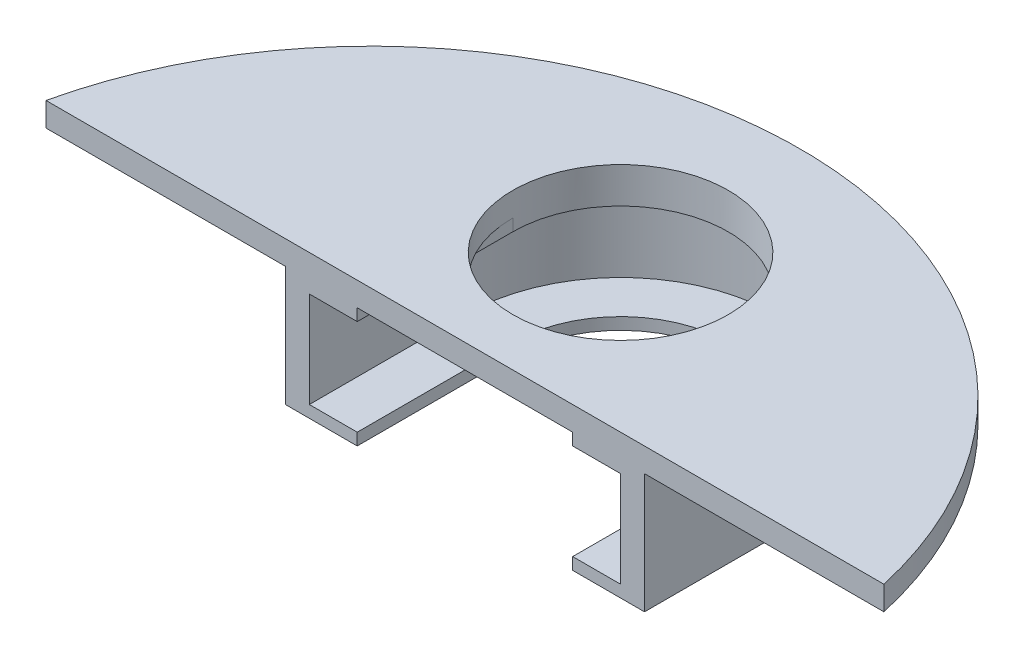
ISO-10303-21;
HEADER;
FILE_DESCRIPTION(('STEP AP214'),'2;1');
FILE_NAME('part.step','',(''),(''),'','','');
FILE_SCHEMA(('AUTOMOTIVE_DESIGN { 1 0 10303 214 1 1 1 1 }'));
ENDSEC;
DATA;
#1=APPLICATION_CONTEXT('core data for automotive mechanical design processes');
#2=APPLICATION_PROTOCOL_DEFINITION('international standard','automotive_design',2000,#1);
#3=PRODUCT_CONTEXT('',#1,'mechanical');
#4=PRODUCT('Part','Part','',(#3));
#5=PRODUCT_RELATED_PRODUCT_CATEGORY('part','',(#4));
#6=PRODUCT_DEFINITION_FORMATION('','',#4);
#7=PRODUCT_DEFINITION_CONTEXT('part definition',#1,'design');
#8=PRODUCT_DEFINITION('design','',#6,#7);
#9=PRODUCT_DEFINITION_SHAPE('','',#8);
#10=(LENGTH_UNIT() NAMED_UNIT(*) SI_UNIT(.MILLI.,.METRE.));
#11=(NAMED_UNIT(*) PLANE_ANGLE_UNIT() SI_UNIT($,.RADIAN.));
#12=(NAMED_UNIT(*) SI_UNIT($,.STERADIAN.) SOLID_ANGLE_UNIT());
#13=UNCERTAINTY_MEASURE_WITH_UNIT(LENGTH_MEASURE(1.E-05),#10,'distance_accuracy_value','');
#14=(GEOMETRIC_REPRESENTATION_CONTEXT(3) GLOBAL_UNCERTAINTY_ASSIGNED_CONTEXT((#13)) GLOBAL_UNIT_ASSIGNED_CONTEXT((#10,
#11,#12)) REPRESENTATION_CONTEXT('',''));
#15=CARTESIAN_POINT('',(0.,0.,0.));
#16=DIRECTION('',(0.,0.,1.));
#17=DIRECTION('',(1.,0.,0.));
#18=AXIS2_PLACEMENT_3D('',#15,#16,#17);
#19=CARTESIAN_POINT('',(0.,0.,0.));
#20=DIRECTION('',(0.,1.,0.));
#21=DIRECTION('',(0.,0.,1.));
#22=AXIS2_PLACEMENT_3D('',#19,#20,#21);
#23=PLANE('',#22);
#24=DIRECTION('',(0.,0.,1.));
#25=VECTOR('',#24,1.);
#26=CARTESIAN_POINT('',(-9.,0.,0.));
#27=LINE('',#26,#25);
#28=CARTESIAN_POINT('',(-9.,0.,0.));
#29=VERTEX_POINT('',#28);
#30=CARTESIAN_POINT('',(-9.,0.,13.));
#31=VERTEX_POINT('',#30);
#32=EDGE_CURVE('E117',#29,#31,#27,.T.);
#33=ORIENTED_EDGE('',*,*,#32,.F.);
#34=CARTESIAN_POINT('',(0.,0.,0.));
#35=DIRECTION('',(0.,1.,0.));
#36=DIRECTION('',(0.,0.,1.));
#37=AXIS2_PLACEMENT_3D('',#34,#35,#36);
#38=CIRCLE('',#37,9.);
#39=CARTESIAN_POINT('',(9.,0.,0.));
#40=VERTEX_POINT('',#39);
#41=EDGE_CURVE('E121',#29,#40,#38,.T.);
#42=ORIENTED_EDGE('',*,*,#41,.T.);
#43=DIRECTION('',(0.,0.,1.));
#44=VECTOR('',#43,1.);
#45=CARTESIAN_POINT('',(9.,0.,0.));
#46=LINE('',#45,#44);
#47=CARTESIAN_POINT('',(9.,0.,13.));
#48=VERTEX_POINT('',#47);
#49=EDGE_CURVE('E309',#40,#48,#46,.T.);
#50=ORIENTED_EDGE('',*,*,#49,.T.);
#51=DIRECTION('',(1.,0.,0.));
#52=VECTOR('',#51,1.);
#53=CARTESIAN_POINT('',(0.,0.,13.));
#54=LINE('',#53,#52);
#55=EDGE_CURVE('E418',#31,#48,#54,.T.);
#56=ORIENTED_EDGE('',*,*,#55,.F.);
#57=EDGE_LOOP('',(#33,#42,#50,#56));
#58=FACE_BOUND('',#57,.T.);
#59=ADVANCED_FACE('F99',(#58),#23,.F.);
#60=CARTESIAN_POINT('',(13.,-9.,0.));
#61=DIRECTION('',(-1.,0.,0.));
#62=DIRECTION('',(0.,0.,1.));
#63=AXIS2_PLACEMENT_3D('',#60,#61,#62);
#64=PLANE('',#63);
#65=DIRECTION('',(0.,1.,0.));
#66=VECTOR('',#65,1.);
#67=CARTESIAN_POINT('',(13.,-9.,13.));
#68=LINE('',#67,#66);
#69=CARTESIAN_POINT('',(13.,-9.,13.));
#70=VERTEX_POINT('',#69);
#71=CARTESIAN_POINT('',(13.,-0.999999999999999,13.));
#72=VERTEX_POINT('',#71);
#73=EDGE_CURVE('E239',#70,#72,#68,.T.);
#74=ORIENTED_EDGE('',*,*,#73,.T.);
#75=DIRECTION('',(0.,0.,1.));
#76=VECTOR('',#75,1.);
#77=CARTESIAN_POINT('',(13.,-1.,0.));
#78=LINE('',#77,#76);
#79=CARTESIAN_POINT('',(13.,-0.999999999999999,0.));
#80=VERTEX_POINT('',#79);
#81=EDGE_CURVE('E322',#80,#72,#78,.T.);
#82=ORIENTED_EDGE('',*,*,#81,.F.);
#83=DIRECTION('',(0.,1.,0.));
#84=VECTOR('',#83,1.);
#85=CARTESIAN_POINT('',(13.,-9.,0.));
#86=LINE('',#85,#84);
#87=CARTESIAN_POINT('',(13.,-9.,0.));
#88=VERTEX_POINT('',#87);
#89=EDGE_CURVE('E379',#88,#80,#86,.T.);
#90=ORIENTED_EDGE('',*,*,#89,.F.);
#91=DIRECTION('',(0.,0.,1.));
#92=VECTOR('',#91,1.);
#93=CARTESIAN_POINT('',(13.,-9.,0.));
#94=LINE('',#93,#92);
#95=EDGE_CURVE('E363',#88,#70,#94,.T.);
#96=ORIENTED_EDGE('',*,*,#95,.T.);
#97=EDGE_LOOP('',(#74,#82,#90,#96));
#98=FACE_BOUND('',#97,.T.);
#99=ADVANCED_FACE('F460',(#98),#64,.T.);
#100=CARTESIAN_POINT('',(0.,-9.,0.));
#101=DIRECTION('',(0.,1.,0.));
#102=DIRECTION('',(0.,0.,1.));
#103=AXIS2_PLACEMENT_3D('',#100,#101,#102);
#104=CYLINDRICAL_SURFACE('',#103,13.);
#105=CARTESIAN_POINT('',(0.,-1.,0.));
#106=DIRECTION('',(0.,1.,0.));
#107=DIRECTION('',(0.,0.,1.));
#108=AXIS2_PLACEMENT_3D('',#105,#106,#107);
#109=CIRCLE('',#108,13.);
#110=CARTESIAN_POINT('',(-13.,-1.,0.));
#111=VERTEX_POINT('',#110);
#112=EDGE_CURVE('E327',#80,#111,#109,.T.);
#113=ORIENTED_EDGE('',*,*,#112,.T.);
#114=DIRECTION('',(0.,1.,0.));
#115=VECTOR('',#114,1.);
#116=CARTESIAN_POINT('',(-13.,-9.,0.));
#117=LINE('',#116,#115);
#118=CARTESIAN_POINT('',(-13.,-9.,0.));
#119=VERTEX_POINT('',#118);
#120=EDGE_CURVE('E383',#119,#111,#117,.T.);
#121=ORIENTED_EDGE('',*,*,#120,.F.);
#122=CARTESIAN_POINT('',(0.,-9.,0.));
#123=DIRECTION('',(0.,1.,0.));
#124=DIRECTION('',(0.,0.,1.));
#125=AXIS2_PLACEMENT_3D('',#122,#123,#124);
#126=CIRCLE('',#125,13.);
#127=EDGE_CURVE('E359',#88,#119,#126,.T.);
#128=ORIENTED_EDGE('',*,*,#127,.F.);
#129=ORIENTED_EDGE('',*,*,#89,.T.);
#130=EDGE_LOOP('',(#113,#121,#128,#129));
#131=FACE_BOUND('',#130,.T.);
#132=ADVANCED_FACE('F463',(#131),#104,.F.);
#133=CARTESIAN_POINT('',(-13.,-9.,0.));
#134=DIRECTION('',(-1.,0.,0.));
#135=DIRECTION('',(0.,0.,1.));
#136=AXIS2_PLACEMENT_3D('',#133,#134,#135);
#137=PLANE('',#136);
#138=DIRECTION('',(0.,0.,1.));
#139=VECTOR('',#138,1.);
#140=CARTESIAN_POINT('',(-13.,-1.,0.));
#141=LINE('',#140,#139);
#142=CARTESIAN_POINT('',(-13.,-0.999999999999999,13.));
#143=VERTEX_POINT('',#142);
#144=EDGE_CURVE('E331',#111,#143,#141,.T.);
#145=ORIENTED_EDGE('',*,*,#144,.T.);
#146=DIRECTION('',(0.,1.,0.));
#147=VECTOR('',#146,1.);
#148=CARTESIAN_POINT('',(-13.,-9.,13.));
#149=LINE('',#148,#147);
#150=CARTESIAN_POINT('',(-13.,-9.,13.));
#151=VERTEX_POINT('',#150);
#152=EDGE_CURVE('E386',#151,#143,#149,.T.);
#153=ORIENTED_EDGE('',*,*,#152,.F.);
#154=DIRECTION('',(0.,0.,1.));
#155=VECTOR('',#154,1.);
#156=CARTESIAN_POINT('',(-13.,-9.,0.));
#157=LINE('',#156,#155);
#158=EDGE_CURVE('E355',#119,#151,#157,.T.);
#159=ORIENTED_EDGE('',*,*,#158,.F.);
#160=ORIENTED_EDGE('',*,*,#120,.T.);
#161=EDGE_LOOP('',(#145,#153,#159,#160));
#162=FACE_BOUND('',#161,.T.);
#163=ADVANCED_FACE('F503',(#162),#137,.F.);
#164=CARTESIAN_POINT('',(0.,0.,0.));
#165=DIRECTION('',(0.,1.,0.));
#166=DIRECTION('',(0.,0.,1.));
#167=AXIS2_PLACEMENT_3D('',#164,#165,#166);
#168=CIRCLE('',#167,15.);
#169=CARTESIAN_POINT('',(0.,0.,-15.));
#170=VERTEX_POINT('',#169);
#171=CARTESIAN_POINT('',(-15.,0.,0.));
#172=VERTEX_POINT('',#171);
#173=EDGE_CURVE('E12',#170,#172,#168,.T.);
#174=ORIENTED_EDGE('',*,*,#173,.T.);
#175=DIRECTION('',(0.,0.,1.));
#176=VECTOR('',#175,1.);
#177=CARTESIAN_POINT('',(-15.,0.,0.));
#178=LINE('',#177,#176);
#179=CARTESIAN_POINT('',(-15.,0.,13.));
#180=VERTEX_POINT('',#179);
#181=EDGE_CURVE('E369',#172,#180,#178,.T.);
#182=ORIENTED_EDGE('',*,*,#181,.T.);
#183=CARTESIAN_POINT('',(-35.,0.,13.));
#184=VERTEX_POINT('',#183);
#185=EDGE_CURVE('E414',#184,#180,#54,.T.);
#186=ORIENTED_EDGE('',*,*,#185,.F.);
#187=CARTESIAN_POINT('',(0.,0.,20.875));
#188=DIRECTION('',(0.,1.,0.));
#189=DIRECTION('',(0.,0.,1.));
#190=AXIS2_PLACEMENT_3D('',#187,#188,#189);
#191=CIRCLE('',#190,35.875);
#192=EDGE_CURVE('E409',#184,#170,#191,.F.);
#193=ORIENTED_EDGE('',*,*,#192,.T.);
#194=EDGE_LOOP('',(#174,#182,#186,#193));
#195=FACE_BOUND('',#194,.T.);
#196=ADVANCED_FACE('F489',(#195),#23,.F.);
#197=CARTESIAN_POINT('',(0.,2.,0.));
#198=DIRECTION('',(0.,-1.,0.));
#199=DIRECTION('',(0.,0.,-1.));
#200=AXIS2_PLACEMENT_3D('',#197,#198,#199);
#201=CYLINDRICAL_SURFACE('',#200,9.);
#202=ORIENTED_EDGE('',*,*,#41,.F.);
#203=DIRECTION('',(0.,1.,0.));
#204=VECTOR('',#203,1.);
#205=CARTESIAN_POINT('',(-9.,-1.,0.));
#206=LINE('',#205,#204);
#207=CARTESIAN_POINT('',(-9.,-1.,0.));
#208=VERTEX_POINT('',#207);
#209=EDGE_CURVE('E342',#208,#29,#206,.T.);
#210=ORIENTED_EDGE('',*,*,#209,.F.);
#211=CARTESIAN_POINT('',(0.,-1.,0.));
#212=DIRECTION('',(0.,1.,0.));
#213=DIRECTION('',(0.,0.,1.));
#214=AXIS2_PLACEMENT_3D('',#211,#212,#213);
#215=CIRCLE('',#214,9.);
#216=CARTESIAN_POINT('',(9.,-1.,0.));
#217=VERTEX_POINT('',#216);
#218=EDGE_CURVE('E310',#217,#208,#215,.T.);
#219=ORIENTED_EDGE('',*,*,#218,.F.);
#220=DIRECTION('',(0.,1.,0.));
#221=VECTOR('',#220,1.);
#222=CARTESIAN_POINT('',(9.,-1.,0.));
#223=LINE('',#222,#221);
#224=EDGE_CURVE('E337',#217,#40,#223,.T.);
#225=ORIENTED_EDGE('',*,*,#224,.T.);
#226=EDGE_LOOP('',(#202,#210,#219,#225));
#227=FACE_BOUND('',#226,.T.);
#228=CARTESIAN_POINT('',(0.,2.,0.));
#229=DIRECTION('',(0.,1.,0.));
#230=DIRECTION('',(0.,0.,1.));
#231=AXIS2_PLACEMENT_3D('',#228,#229,#230);
#232=CIRCLE('',#231,9.);
#233=CARTESIAN_POINT('',(0.,2.,9.));
#234=VERTEX_POINT('',#233);
#235=EDGE_CURVE('E404',#234,#234,#232,.T.);
#236=ORIENTED_EDGE('',*,*,#235,.T.);
#237=EDGE_LOOP('',(#236));
#238=FACE_BOUND('',#237,.T.);
#239=ADVANCED_FACE('F452',(#227,#238),#201,.F.);
#240=DIRECTION('',(0.,0.,1.));
#241=VECTOR('',#240,1.);
#242=CARTESIAN_POINT('',(15.,0.,0.));
#243=LINE('',#242,#241);
#244=CARTESIAN_POINT('',(15.,0.,0.));
#245=VERTEX_POINT('',#244);
#246=CARTESIAN_POINT('',(15.,0.,13.));
#247=VERTEX_POINT('',#246);
#248=EDGE_CURVE('E234',#245,#247,#243,.T.);
#249=ORIENTED_EDGE('',*,*,#248,.F.);
#250=EDGE_CURVE('E110',#245,#170,#168,.T.);
#251=ORIENTED_EDGE('',*,*,#250,.T.);
#252=CARTESIAN_POINT('',(35.,0.,13.));
#253=VERTEX_POINT('',#252);
#254=EDGE_CURVE('E375',#170,#253,#191,.F.);
#255=ORIENTED_EDGE('',*,*,#254,.T.);
#256=EDGE_CURVE('E413',#247,#253,#54,.T.);
#257=ORIENTED_EDGE('',*,*,#256,.F.);
#258=EDGE_LOOP('',(#249,#251,#255,#257));
#259=FACE_BOUND('',#258,.T.);
#260=ADVANCED_FACE('F433',(#259),#23,.F.);
#261=CARTESIAN_POINT('',(0.,2.,13.));
#262=DIRECTION('',(0.,0.,-1.));
#263=DIRECTION('',(-1.,0.,0.));
#264=AXIS2_PLACEMENT_3D('',#261,#262,#263);
#265=PLANE('',#264);
#266=DIRECTION('',(0.,1.,0.));
#267=VECTOR('',#266,1.);
#268=CARTESIAN_POINT('',(-9.,-1.,13.));
#269=LINE('',#268,#267);
#270=CARTESIAN_POINT('',(-9.,-1.,13.));
#271=VERTEX_POINT('',#270);
#272=EDGE_CURVE('E346',#271,#31,#269,.T.);
#273=ORIENTED_EDGE('',*,*,#272,.T.);
#274=ORIENTED_EDGE('',*,*,#55,.T.);
#275=DIRECTION('',(0.,1.,0.));
#276=VECTOR('',#275,1.);
#277=CARTESIAN_POINT('',(9.,-1.,13.));
#278=LINE('',#277,#276);
#279=CARTESIAN_POINT('',(9.,-1.,13.));
#280=VERTEX_POINT('',#279);
#281=EDGE_CURVE('E349',#280,#48,#278,.T.);
#282=ORIENTED_EDGE('',*,*,#281,.F.);
#283=DIRECTION('',(1.,0.,0.));
#284=VECTOR('',#283,1.);
#285=CARTESIAN_POINT('',(0.,-1.,13.));
#286=LINE('',#285,#284);
#287=EDGE_CURVE('E318',#280,#72,#286,.T.);
#288=ORIENTED_EDGE('',*,*,#287,.T.);
#289=ORIENTED_EDGE('',*,*,#73,.F.);
#290=DIRECTION('',(1.,0.,0.));
#291=VECTOR('',#290,1.);
#292=CARTESIAN_POINT('',(0.,-9.,13.));
#293=LINE('',#292,#291);
#294=CARTESIAN_POINT('',(9.,-9.,13.));
#295=VERTEX_POINT('',#294);
#296=EDGE_CURVE('E280',#295,#70,#293,.T.);
#297=ORIENTED_EDGE('',*,*,#296,.F.);
#298=DIRECTION('',(0.,1.,0.));
#299=VECTOR('',#298,1.);
#300=CARTESIAN_POINT('',(9.,-10.,13.));
#301=LINE('',#300,#299);
#302=CARTESIAN_POINT('',(9.,-10.,13.));
#303=VERTEX_POINT('',#302);
#304=EDGE_CURVE('E256',#303,#295,#301,.T.);
#305=ORIENTED_EDGE('',*,*,#304,.F.);
#306=DIRECTION('',(1.,0.,0.));
#307=VECTOR('',#306,1.);
#308=CARTESIAN_POINT('',(0.,-10.,13.));
#309=LINE('',#308,#307);
#310=CARTESIAN_POINT('',(15.,-10.,13.));
#311=VERTEX_POINT('',#310);
#312=EDGE_CURVE('E245',#303,#311,#309,.T.);
#313=ORIENTED_EDGE('',*,*,#312,.T.);
#314=DIRECTION('',(0.,1.,0.));
#315=VECTOR('',#314,1.);
#316=CARTESIAN_POINT('',(15.,-9.,13.));
#317=LINE('',#316,#315);
#318=EDGE_CURVE('E228',#311,#247,#317,.T.);
#319=ORIENTED_EDGE('',*,*,#318,.T.);
#320=ORIENTED_EDGE('',*,*,#256,.T.);
#321=DIRECTION('',(0.,-1.,0.));
#322=VECTOR('',#321,1.);
#323=CARTESIAN_POINT('',(35.,2.,13.));
#324=LINE('',#323,#322);
#325=CARTESIAN_POINT('',(35.,2.,13.));
#326=VERTEX_POINT('',#325);
#327=EDGE_CURVE('E103',#326,#253,#324,.T.);
#328=ORIENTED_EDGE('',*,*,#327,.F.);
#329=DIRECTION('',(1.,0.,0.));
#330=VECTOR('',#329,1.);
#331=CARTESIAN_POINT('',(0.,2.,13.));
#332=LINE('',#331,#330);
#333=CARTESIAN_POINT('',(-35.,2.,13.));
#334=VERTEX_POINT('',#333);
#335=EDGE_CURVE('E397',#334,#326,#332,.T.);
#336=ORIENTED_EDGE('',*,*,#335,.F.);
#337=DIRECTION('',(0.,-1.,0.));
#338=VECTOR('',#337,1.);
#339=CARTESIAN_POINT('',(-35.,2.,13.));
#340=LINE('',#339,#338);
#341=EDGE_CURVE('E408',#334,#184,#340,.T.);
#342=ORIENTED_EDGE('',*,*,#341,.T.);
#343=ORIENTED_EDGE('',*,*,#185,.T.);
#344=DIRECTION('',(0.,1.,0.));
#345=VECTOR('',#344,1.);
#346=CARTESIAN_POINT('',(-15.,-9.,13.));
#347=LINE('',#346,#345);
#348=CARTESIAN_POINT('',(-15.,-10.,13.));
#349=VERTEX_POINT('',#348);
#350=EDGE_CURVE('E390',#349,#180,#347,.T.);
#351=ORIENTED_EDGE('',*,*,#350,.F.);
#352=DIRECTION('',(1.,0.,0.));
#353=VECTOR('',#352,1.);
#354=CARTESIAN_POINT('',(0.,-10.,13.));
#355=LINE('',#354,#353);
#356=CARTESIAN_POINT('',(-9.,-10.,13.));
#357=VERTEX_POINT('',#356);
#358=EDGE_CURVE('E269',#349,#357,#355,.T.);
#359=ORIENTED_EDGE('',*,*,#358,.T.);
#360=DIRECTION('',(0.,1.,0.));
#361=VECTOR('',#360,1.);
#362=CARTESIAN_POINT('',(-9.,-10.,13.));
#363=LINE('',#362,#361);
#364=CARTESIAN_POINT('',(-9.,-9.,13.));
#365=VERTEX_POINT('',#364);
#366=EDGE_CURVE('E279',#357,#365,#363,.T.);
#367=ORIENTED_EDGE('',*,*,#366,.T.);
#368=DIRECTION('',(1.,0.,0.));
#369=VECTOR('',#368,1.);
#370=CARTESIAN_POINT('',(0.,-9.,13.));
#371=LINE('',#370,#369);
#372=EDGE_CURVE('E251',#151,#365,#371,.T.);
#373=ORIENTED_EDGE('',*,*,#372,.F.);
#374=ORIENTED_EDGE('',*,*,#152,.T.);
#375=EDGE_CURVE('E323',#143,#271,#286,.T.);
#376=ORIENTED_EDGE('',*,*,#375,.T.);
#377=EDGE_LOOP('',(#273,#274,#282,#288,#289,#297,#305,#313,#319,#320,#328,#336,#342,#343,#351,
#359,#367,#373,#374,#376));
#378=FACE_BOUND('',#377,.T.);
#379=ADVANCED_FACE('F254',(#378),#265,.F.);
#380=CARTESIAN_POINT('',(0.,2.,20.875));
#381=DIRECTION('',(0.,-1.,0.));
#382=DIRECTION('',(0.,0.,-1.));
#383=AXIS2_PLACEMENT_3D('',#380,#381,#382);
#384=CYLINDRICAL_SURFACE('',#383,35.875);
#385=ORIENTED_EDGE('',*,*,#192,.F.);
#386=ORIENTED_EDGE('',*,*,#341,.F.);
#387=CARTESIAN_POINT('',(0.,2.,20.875));
#388=DIRECTION('',(0.,1.,0.));
#389=DIRECTION('',(0.,0.,1.));
#390=AXIS2_PLACEMENT_3D('',#387,#388,#389);
#391=CIRCLE('',#390,35.875);
#392=EDGE_CURVE('E400',#334,#326,#391,.F.);
#393=ORIENTED_EDGE('',*,*,#392,.T.);
#394=ORIENTED_EDGE('',*,*,#327,.T.);
#395=ORIENTED_EDGE('',*,*,#254,.F.);
#396=EDGE_LOOP('',(#385,#386,#393,#394,#395));
#397=FACE_BOUND('',#396,.T.);
#398=ADVANCED_FACE('F101',(#397),#384,.T.);
#399=CARTESIAN_POINT('',(0.,2.,0.));
#400=DIRECTION('',(0.,1.,0.));
#401=DIRECTION('',(0.,0.,1.));
#402=AXIS2_PLACEMENT_3D('',#399,#400,#401);
#403=PLANE('',#402);
#404=ORIENTED_EDGE('',*,*,#392,.F.);
#405=ORIENTED_EDGE('',*,*,#335,.T.);
#406=EDGE_LOOP('',(#404,#405));
#407=FACE_BOUND('',#406,.T.);
#408=ORIENTED_EDGE('',*,*,#235,.F.);
#409=EDGE_LOOP('',(#408));
#410=FACE_BOUND('',#409,.T.);
#411=ADVANCED_FACE('F491',(#407,#410),#403,.T.);
#412=CARTESIAN_POINT('',(0.,-9.,0.));
#413=DIRECTION('',(0.,1.,0.));
#414=DIRECTION('',(0.,0.,1.));
#415=AXIS2_PLACEMENT_3D('',#412,#413,#414);
#416=CYLINDRICAL_SURFACE('',#415,15.);
#417=ORIENTED_EDGE('',*,*,#250,.F.);
#418=DIRECTION('',(0.,1.,0.));
#419=VECTOR('',#418,1.);
#420=CARTESIAN_POINT('',(15.,-9.,0.));
#421=LINE('',#420,#419);
#422=CARTESIAN_POINT('',(15.,-10.,0.));
#423=VERTEX_POINT('',#422);
#424=EDGE_CURVE('E238',#423,#245,#421,.T.);
#425=ORIENTED_EDGE('',*,*,#424,.F.);
#426=CARTESIAN_POINT('',(0.,-10.,0.));
#427=DIRECTION('',(0.,1.,0.));
#428=DIRECTION('',(0.,0.,1.));
#429=AXIS2_PLACEMENT_3D('',#426,#427,#428);
#430=CIRCLE('',#429,15.);
#431=CARTESIAN_POINT('',(-15.,-10.,0.));
#432=VERTEX_POINT('',#431);
#433=EDGE_CURVE('E249',#423,#432,#430,.T.);
#434=ORIENTED_EDGE('',*,*,#433,.T.);
#435=DIRECTION('',(0.,1.,0.));
#436=VECTOR('',#435,1.);
#437=CARTESIAN_POINT('',(-15.,-9.,0.));
#438=LINE('',#437,#436);
#439=EDGE_CURVE('E366',#432,#172,#438,.T.);
#440=ORIENTED_EDGE('',*,*,#439,.T.);
#441=ORIENTED_EDGE('',*,*,#173,.F.);
#442=EDGE_LOOP('',(#417,#425,#434,#440,#441));
#443=FACE_BOUND('',#442,.T.);
#444=ADVANCED_FACE('F487',(#443),#416,.T.);
#445=CARTESIAN_POINT('',(15.,-9.,0.));
#446=DIRECTION('',(-1.,0.,0.));
#447=DIRECTION('',(0.,0.,1.));
#448=AXIS2_PLACEMENT_3D('',#445,#446,#447);
#449=PLANE('',#448);
#450=ORIENTED_EDGE('',*,*,#248,.T.);
#451=ORIENTED_EDGE('',*,*,#318,.F.);
#452=DIRECTION('',(0.,0.,1.));
#453=VECTOR('',#452,1.);
#454=CARTESIAN_POINT('',(15.,-10.,0.));
#455=LINE('',#454,#453);
#456=EDGE_CURVE('E232',#423,#311,#455,.T.);
#457=ORIENTED_EDGE('',*,*,#456,.F.);
#458=ORIENTED_EDGE('',*,*,#424,.T.);
#459=EDGE_LOOP('',(#450,#451,#457,#458));
#460=FACE_BOUND('',#459,.T.);
#461=ADVANCED_FACE('F230',(#460),#449,.F.);
#462=CARTESIAN_POINT('',(-15.,-9.,0.));
#463=DIRECTION('',(-1.,0.,0.));
#464=DIRECTION('',(0.,0.,1.));
#465=AXIS2_PLACEMENT_3D('',#462,#463,#464);
#466=PLANE('',#465);
#467=ORIENTED_EDGE('',*,*,#181,.F.);
#468=ORIENTED_EDGE('',*,*,#439,.F.);
#469=DIRECTION('',(0.,0.,1.));
#470=VECTOR('',#469,1.);
#471=CARTESIAN_POINT('',(-15.,-10.,0.));
#472=LINE('',#471,#470);
#473=EDGE_CURVE('E273',#432,#349,#472,.T.);
#474=ORIENTED_EDGE('',*,*,#473,.T.);
#475=ORIENTED_EDGE('',*,*,#350,.T.);
#476=EDGE_LOOP('',(#467,#468,#474,#475));
#477=FACE_BOUND('',#476,.T.);
#478=ADVANCED_FACE('F484',(#477),#466,.T.);
#479=CARTESIAN_POINT('',(-9.,-1.,0.));
#480=DIRECTION('',(-1.,0.,0.));
#481=DIRECTION('',(0.,0.,1.));
#482=AXIS2_PLACEMENT_3D('',#479,#480,#481);
#483=PLANE('',#482);
#484=ORIENTED_EDGE('',*,*,#32,.T.);
#485=ORIENTED_EDGE('',*,*,#272,.F.);
#486=DIRECTION('',(0.,0.,1.));
#487=VECTOR('',#486,1.);
#488=CARTESIAN_POINT('',(-9.,-1.,0.));
#489=LINE('',#488,#487);
#490=EDGE_CURVE('E334',#208,#271,#489,.T.);
#491=ORIENTED_EDGE('',*,*,#490,.F.);
#492=ORIENTED_EDGE('',*,*,#209,.T.);
#493=EDGE_LOOP('',(#484,#485,#491,#492));
#494=FACE_BOUND('',#493,.T.);
#495=ADVANCED_FACE('F450',(#494),#483,.F.);
#496=CARTESIAN_POINT('',(9.,-1.,0.));
#497=DIRECTION('',(-1.,0.,0.));
#498=DIRECTION('',(0.,0.,1.));
#499=AXIS2_PLACEMENT_3D('',#496,#497,#498);
#500=PLANE('',#499);
#501=ORIENTED_EDGE('',*,*,#49,.F.);
#502=ORIENTED_EDGE('',*,*,#224,.F.);
#503=DIRECTION('',(0.,0.,1.));
#504=VECTOR('',#503,1.);
#505=CARTESIAN_POINT('',(9.,-1.,0.));
#506=LINE('',#505,#504);
#507=EDGE_CURVE('E314',#217,#280,#506,.T.);
#508=ORIENTED_EDGE('',*,*,#507,.T.);
#509=ORIENTED_EDGE('',*,*,#281,.T.);
#510=EDGE_LOOP('',(#501,#502,#508,#509));
#511=FACE_BOUND('',#510,.T.);
#512=ADVANCED_FACE('F456',(#511),#500,.T.);
#513=CARTESIAN_POINT('',(0.,-1.,0.));
#514=DIRECTION('',(0.,1.,0.));
#515=DIRECTION('',(0.,0.,1.));
#516=AXIS2_PLACEMENT_3D('',#513,#514,#515);
#517=PLANE('',#516);
#518=ORIENTED_EDGE('',*,*,#218,.T.);
#519=ORIENTED_EDGE('',*,*,#490,.T.);
#520=ORIENTED_EDGE('',*,*,#375,.F.);
#521=ORIENTED_EDGE('',*,*,#144,.F.);
#522=ORIENTED_EDGE('',*,*,#112,.F.);
#523=ORIENTED_EDGE('',*,*,#81,.T.);
#524=ORIENTED_EDGE('',*,*,#287,.F.);
#525=ORIENTED_EDGE('',*,*,#507,.F.);
#526=EDGE_LOOP('',(#518,#519,#520,#521,#522,#523,#524,#525));
#527=FACE_BOUND('',#526,.T.);
#528=ADVANCED_FACE('F444',(#527),#517,.F.);
#529=CARTESIAN_POINT('',(0.,-9.,0.));
#530=DIRECTION('',(0.,1.,0.));
#531=DIRECTION('',(0.,0.,1.));
#532=AXIS2_PLACEMENT_3D('',#529,#530,#531);
#533=PLANE('',#532);
#534=ORIENTED_EDGE('',*,*,#95,.F.);
#535=ORIENTED_EDGE('',*,*,#127,.T.);
#536=ORIENTED_EDGE('',*,*,#158,.T.);
#537=ORIENTED_EDGE('',*,*,#372,.T.);
#538=DIRECTION('',(0.,0.,1.));
#539=VECTOR('',#538,1.);
#540=CARTESIAN_POINT('',(-9.,-9.,0.));
#541=LINE('',#540,#539);
#542=CARTESIAN_POINT('',(-9.,-9.,0.));
#543=VERTEX_POINT('',#542);
#544=EDGE_CURVE('E291',#543,#365,#541,.T.);
#545=ORIENTED_EDGE('',*,*,#544,.F.);
#546=CARTESIAN_POINT('',(0.,-9.,0.));
#547=DIRECTION('',(0.,1.,0.));
#548=DIRECTION('',(0.,0.,1.));
#549=AXIS2_PLACEMENT_3D('',#546,#547,#548);
#550=CIRCLE('',#549,9.);
#551=CARTESIAN_POINT('',(9.,-9.,0.));
#552=VERTEX_POINT('',#551);
#553=EDGE_CURVE('E288',#552,#543,#550,.T.);
#554=ORIENTED_EDGE('',*,*,#553,.F.);
#555=DIRECTION('',(0.,0.,1.));
#556=VECTOR('',#555,1.);
#557=CARTESIAN_POINT('',(9.,-9.,0.));
#558=LINE('',#557,#556);
#559=EDGE_CURVE('E284',#552,#295,#558,.T.);
#560=ORIENTED_EDGE('',*,*,#559,.T.);
#561=ORIENTED_EDGE('',*,*,#296,.T.);
#562=EDGE_LOOP('',(#534,#535,#536,#537,#545,#554,#560,#561));
#563=FACE_BOUND('',#562,.T.);
#564=ADVANCED_FACE('F467',(#563),#533,.T.);
#565=CARTESIAN_POINT('',(9.,-10.,0.));
#566=DIRECTION('',(-1.,0.,0.));
#567=DIRECTION('',(0.,0.,1.));
#568=AXIS2_PLACEMENT_3D('',#565,#566,#567);
#569=PLANE('',#568);
#570=ORIENTED_EDGE('',*,*,#559,.F.);
#571=DIRECTION('',(0.,1.,0.));
#572=VECTOR('',#571,1.);
#573=CARTESIAN_POINT('',(9.,-10.,0.));
#574=LINE('',#573,#572);
#575=CARTESIAN_POINT('',(9.,-10.,0.));
#576=VERTEX_POINT('',#575);
#577=EDGE_CURVE('E304',#576,#552,#574,.T.);
#578=ORIENTED_EDGE('',*,*,#577,.F.);
#579=DIRECTION('',(0.,0.,1.));
#580=VECTOR('',#579,1.);
#581=CARTESIAN_POINT('',(9.,-10.,0.));
#582=LINE('',#581,#580);
#583=EDGE_CURVE('E258',#576,#303,#582,.T.);
#584=ORIENTED_EDGE('',*,*,#583,.T.);
#585=ORIENTED_EDGE('',*,*,#304,.T.);
#586=EDGE_LOOP('',(#570,#578,#584,#585));
#587=FACE_BOUND('',#586,.T.);
#588=ADVANCED_FACE('F472',(#587),#569,.T.);
#589=CARTESIAN_POINT('',(0.,-10.,0.));
#590=DIRECTION('',(0.,1.,0.));
#591=DIRECTION('',(0.,0.,1.));
#592=AXIS2_PLACEMENT_3D('',#589,#590,#591);
#593=CYLINDRICAL_SURFACE('',#592,9.);
#594=ORIENTED_EDGE('',*,*,#553,.T.);
#595=DIRECTION('',(0.,1.,0.));
#596=VECTOR('',#595,1.);
#597=CARTESIAN_POINT('',(-9.,-10.,0.));
#598=LINE('',#597,#596);
#599=CARTESIAN_POINT('',(-9.,-10.,0.));
#600=VERTEX_POINT('',#599);
#601=EDGE_CURVE('E300',#600,#543,#598,.T.);
#602=ORIENTED_EDGE('',*,*,#601,.F.);
#603=CARTESIAN_POINT('',(0.,-10.,0.));
#604=DIRECTION('',(0.,1.,0.));
#605=DIRECTION('',(0.,0.,1.));
#606=AXIS2_PLACEMENT_3D('',#603,#604,#605);
#607=CIRCLE('',#606,9.);
#608=EDGE_CURVE('E261',#576,#600,#607,.T.);
#609=ORIENTED_EDGE('',*,*,#608,.F.);
#610=ORIENTED_EDGE('',*,*,#577,.T.);
#611=EDGE_LOOP('',(#594,#602,#609,#610));
#612=FACE_BOUND('',#611,.T.);
#613=ADVANCED_FACE('F479',(#612),#593,.F.);
#614=CARTESIAN_POINT('',(-9.,-10.,0.));
#615=DIRECTION('',(-1.,0.,0.));
#616=DIRECTION('',(0.,0.,1.));
#617=AXIS2_PLACEMENT_3D('',#614,#615,#616);
#618=PLANE('',#617);
#619=ORIENTED_EDGE('',*,*,#544,.T.);
#620=ORIENTED_EDGE('',*,*,#366,.F.);
#621=DIRECTION('',(0.,0.,1.));
#622=VECTOR('',#621,1.);
#623=CARTESIAN_POINT('',(-9.,-10.,0.));
#624=LINE('',#623,#622);
#625=EDGE_CURVE('E266',#600,#357,#624,.T.);
#626=ORIENTED_EDGE('',*,*,#625,.F.);
#627=ORIENTED_EDGE('',*,*,#601,.T.);
#628=EDGE_LOOP('',(#619,#620,#626,#627));
#629=FACE_BOUND('',#628,.T.);
#630=ADVANCED_FACE('F481',(#629),#618,.F.);
#631=CARTESIAN_POINT('',(0.,-10.,0.));
#632=DIRECTION('',(0.,1.,0.));
#633=DIRECTION('',(0.,0.,1.));
#634=AXIS2_PLACEMENT_3D('',#631,#632,#633);
#635=PLANE('',#634);
#636=ORIENTED_EDGE('',*,*,#456,.T.);
#637=ORIENTED_EDGE('',*,*,#312,.F.);
#638=ORIENTED_EDGE('',*,*,#583,.F.);
#639=ORIENTED_EDGE('',*,*,#608,.T.);
#640=ORIENTED_EDGE('',*,*,#625,.T.);
#641=ORIENTED_EDGE('',*,*,#358,.F.);
#642=ORIENTED_EDGE('',*,*,#473,.F.);
#643=ORIENTED_EDGE('',*,*,#433,.F.);
#644=EDGE_LOOP('',(#636,#637,#638,#639,#640,#641,#642,#643));
#645=FACE_BOUND('',#644,.T.);
#646=ADVANCED_FACE('F243',(#645),#635,.F.);
#647=CLOSED_SHELL('',(#59,#99,#132,#163,#196,#239,#260,#379,#398,#411,#444,#461,#478,#495,#512,
#528,#564,#588,#613,#630,#646));
#648=MANIFOLD_SOLID_BREP('B2',#647);
#649=ADVANCED_BREP_SHAPE_REPRESENTATION('',(#18,#648),#14);
#650=SHAPE_DEFINITION_REPRESENTATION(#9,#649);
ENDSEC;
END-ISO-10303-21;
